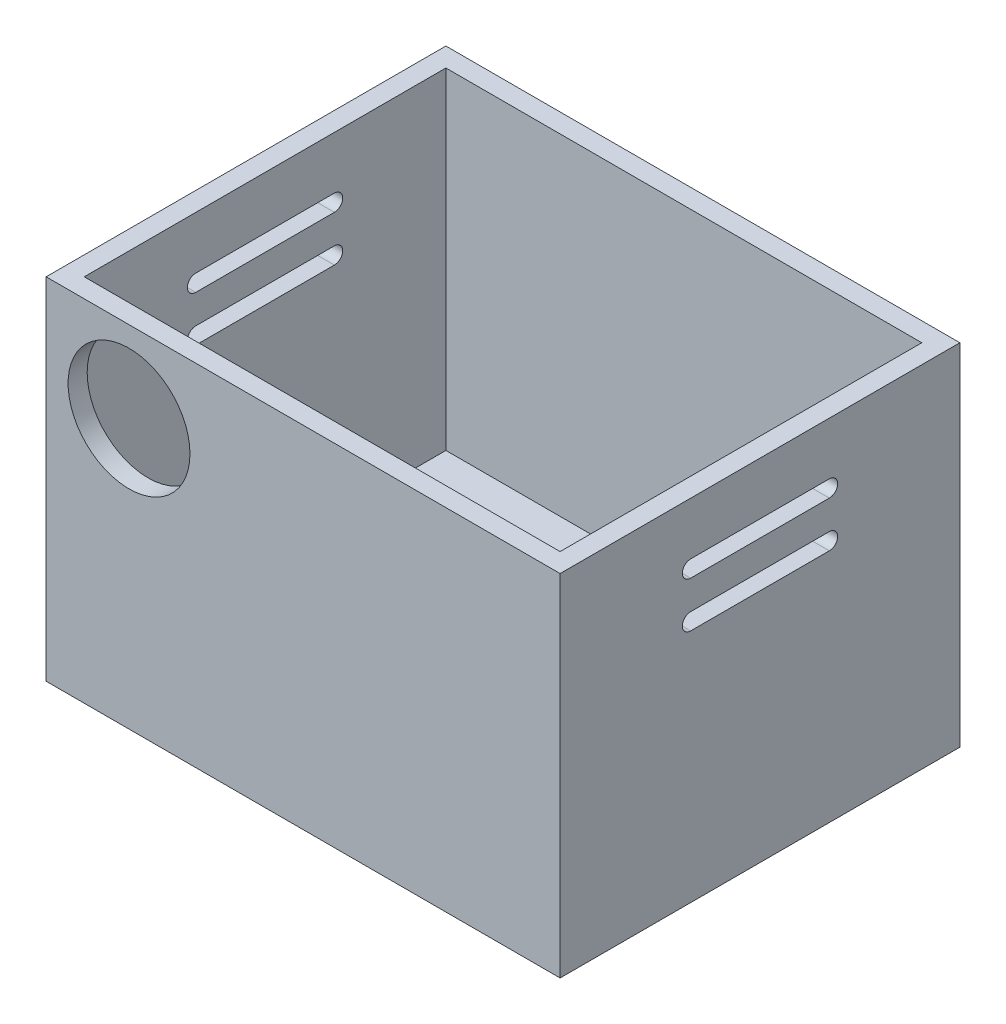
ISO-10303-21;
HEADER;
FILE_DESCRIPTION(('STEP AP214'),'2;1');
FILE_NAME('part.step','',(''),(''),'','','');
FILE_SCHEMA(('AUTOMOTIVE_DESIGN { 1 0 10303 214 1 1 1 1 }'));
ENDSEC;
DATA;
#1=APPLICATION_CONTEXT('core data for automotive mechanical design processes');
#2=APPLICATION_PROTOCOL_DEFINITION('international standard','automotive_design',2000,#1);
#3=PRODUCT_CONTEXT('',#1,'mechanical');
#4=PRODUCT('Part','Part','',(#3));
#5=PRODUCT_RELATED_PRODUCT_CATEGORY('part','',(#4));
#6=PRODUCT_DEFINITION_FORMATION('','',#4);
#7=PRODUCT_DEFINITION_CONTEXT('part definition',#1,'design');
#8=PRODUCT_DEFINITION('design','',#6,#7);
#9=PRODUCT_DEFINITION_SHAPE('','',#8);
#10=(LENGTH_UNIT() NAMED_UNIT(*) SI_UNIT(.MILLI.,.METRE.));
#11=(NAMED_UNIT(*) PLANE_ANGLE_UNIT() SI_UNIT($,.RADIAN.));
#12=(NAMED_UNIT(*) SI_UNIT($,.STERADIAN.) SOLID_ANGLE_UNIT());
#13=UNCERTAINTY_MEASURE_WITH_UNIT(LENGTH_MEASURE(1.E-05),#10,'distance_accuracy_value','');
#14=(GEOMETRIC_REPRESENTATION_CONTEXT(3) GLOBAL_UNCERTAINTY_ASSIGNED_CONTEXT((#13)) GLOBAL_UNIT_ASSIGNED_CONTEXT((#10,
#11,#12)) REPRESENTATION_CONTEXT('',''));
#15=CARTESIAN_POINT('',(0.,0.,0.));
#16=DIRECTION('',(0.,0.,1.));
#17=DIRECTION('',(1.,0.,0.));
#18=AXIS2_PLACEMENT_3D('',#15,#16,#17);
#19=CARTESIAN_POINT('',(42.8625,58.42,-33.3375));
#20=DIRECTION('',(1.,0.,0.));
#21=DIRECTION('',(0.,0.,-1.));
#22=AXIS2_PLACEMENT_3D('',#19,#20,#21);
#23=PLANE('',#22);
#24=CARTESIAN_POINT('',(42.8625,48.26,11.564874));
#25=DIRECTION('',(1.,0.,0.));
#26=DIRECTION('',(0.,0.,-1.));
#27=AXIS2_PLACEMENT_3D('',#24,#25,#26);
#28=CIRCLE('',#27,1.38912599999999);
#29=CARTESIAN_POINT('',(42.8625,49.649126,11.564874));
#30=VERTEX_POINT('',#29);
#31=CARTESIAN_POINT('',(42.8625,46.870874,11.564874));
#32=VERTEX_POINT('',#31);
#33=EDGE_CURVE('E375',#30,#32,#28,.T.);
#34=ORIENTED_EDGE('',*,*,#33,.F.);
#35=DIRECTION('',(0.,0.,1.));
#36=VECTOR('',#35,1.);
#37=CARTESIAN_POINT('',(42.8625,49.649126,-11.564874));
#38=LINE('',#37,#36);
#39=CARTESIAN_POINT('',(42.8625,49.649126,-11.564874));
#40=VERTEX_POINT('',#39);
#41=EDGE_CURVE('E361',#40,#30,#38,.T.);
#42=ORIENTED_EDGE('',*,*,#41,.F.);
#43=CARTESIAN_POINT('',(42.8625,48.26,-11.564874));
#44=DIRECTION('',(1.,0.,0.));
#45=DIRECTION('',(0.,0.,-1.));
#46=AXIS2_PLACEMENT_3D('',#43,#44,#45);
#47=CIRCLE('',#46,1.38912599999999);
#48=CARTESIAN_POINT('',(42.8625,46.870874,-11.564874));
#49=VERTEX_POINT('',#48);
#50=EDGE_CURVE('E366',#49,#40,#47,.T.);
#51=ORIENTED_EDGE('',*,*,#50,.F.);
#52=DIRECTION('',(0.,0.,1.));
#53=VECTOR('',#52,1.);
#54=CARTESIAN_POINT('',(42.8625,46.870874,-11.564874));
#55=LINE('',#54,#53);
#56=EDGE_CURVE('E350',#49,#32,#55,.T.);
#57=ORIENTED_EDGE('',*,*,#56,.T.);
#58=EDGE_LOOP('',(#34,#42,#51,#57));
#59=FACE_BOUND('',#58,.T.);
#60=DIRECTION('',(0.,0.,1.));
#61=VECTOR('',#60,1.);
#62=CARTESIAN_POINT('',(42.8625,0.,-33.3375));
#63=LINE('',#62,#61);
#64=CARTESIAN_POINT('',(42.8625,0.,-33.3375));
#65=VERTEX_POINT('',#64);
#66=CARTESIAN_POINT('',(42.8625,0.,33.3375));
#67=VERTEX_POINT('',#66);
#68=EDGE_CURVE('E493',#65,#67,#63,.T.);
#69=ORIENTED_EDGE('',*,*,#68,.F.);
#70=DIRECTION('',(0.,-1.,0.));
#71=VECTOR('',#70,1.);
#72=CARTESIAN_POINT('',(42.8625,58.42,-33.3375));
#73=LINE('',#72,#71);
#74=CARTESIAN_POINT('',(42.8625,58.42,-33.3375));
#75=VERTEX_POINT('',#74);
#76=EDGE_CURVE('E499',#75,#65,#73,.T.);
#77=ORIENTED_EDGE('',*,*,#76,.F.);
#78=DIRECTION('',(0.,0.,1.));
#79=VECTOR('',#78,1.);
#80=CARTESIAN_POINT('',(42.8625,58.42,-33.3375));
#81=LINE('',#80,#79);
#82=CARTESIAN_POINT('',(42.8625,58.42,33.3375));
#83=VERTEX_POINT('',#82);
#84=EDGE_CURVE('E481',#75,#83,#81,.T.);
#85=ORIENTED_EDGE('',*,*,#84,.T.);
#86=DIRECTION('',(0.,-1.,0.));
#87=VECTOR('',#86,1.);
#88=CARTESIAN_POINT('',(42.8625,58.42,33.3375));
#89=LINE('',#88,#87);
#90=EDGE_CURVE('E501',#83,#67,#89,.T.);
#91=ORIENTED_EDGE('',*,*,#90,.T.);
#92=EDGE_LOOP('',(#69,#77,#85,#91));
#93=FACE_BOUND('',#92,.T.);
#94=CARTESIAN_POINT('',(42.8625,40.64,-11.564874));
#95=DIRECTION('',(1.,0.,0.));
#96=DIRECTION('',(0.,0.,-1.));
#97=AXIS2_PLACEMENT_3D('',#94,#95,#96);
#98=CIRCLE('',#97,1.38912599999999);
#99=CARTESIAN_POINT('',(42.8625,39.250874,-11.564874));
#100=VERTEX_POINT('',#99);
#101=CARTESIAN_POINT('',(42.8625,42.029126,-11.564874));
#102=VERTEX_POINT('',#101);
#103=EDGE_CURVE('E405',#100,#102,#98,.T.);
#104=ORIENTED_EDGE('',*,*,#103,.F.);
#105=DIRECTION('',(0.,0.,1.));
#106=VECTOR('',#105,1.);
#107=CARTESIAN_POINT('',(42.8625,39.250874,-11.564874));
#108=LINE('',#107,#106);
#109=CARTESIAN_POINT('',(42.8625,39.250874,11.564874));
#110=VERTEX_POINT('',#109);
#111=EDGE_CURVE('E398',#100,#110,#108,.T.);
#112=ORIENTED_EDGE('',*,*,#111,.T.);
#113=CARTESIAN_POINT('',(42.8625,40.64,11.564874));
#114=DIRECTION('',(1.,0.,0.));
#115=DIRECTION('',(0.,0.,-1.));
#116=AXIS2_PLACEMENT_3D('',#113,#114,#115);
#117=CIRCLE('',#116,1.38912599999999);
#118=CARTESIAN_POINT('',(42.8625,42.029126,11.564874));
#119=VERTEX_POINT('',#118);
#120=EDGE_CURVE('E419',#119,#110,#117,.T.);
#121=ORIENTED_EDGE('',*,*,#120,.F.);
#122=DIRECTION('',(0.,0.,1.));
#123=VECTOR('',#122,1.);
#124=CARTESIAN_POINT('',(42.8625,42.029126,-11.564874));
#125=LINE('',#124,#123);
#126=EDGE_CURVE('E391',#102,#119,#125,.T.);
#127=ORIENTED_EDGE('',*,*,#126,.F.);
#128=EDGE_LOOP('',(#104,#112,#121,#127));
#129=FACE_BOUND('',#128,.T.);
#130=ADVANCED_FACE('F183',(#59,#93,#129),#23,.T.);
#131=CARTESIAN_POINT('',(-42.8625,58.42,-33.3375));
#132=DIRECTION('',(1.,0.,0.));
#133=DIRECTION('',(0.,0.,-1.));
#134=AXIS2_PLACEMENT_3D('',#131,#132,#133);
#135=PLANE('',#134);
#136=DIRECTION('',(0.,0.,1.));
#137=VECTOR('',#136,1.);
#138=CARTESIAN_POINT('',(-42.8625,49.649126,-11.564874));
#139=LINE('',#138,#137);
#140=CARTESIAN_POINT('',(-42.8625,49.649126,-11.564874));
#141=VERTEX_POINT('',#140);
#142=CARTESIAN_POINT('',(-42.8625,49.649126,11.564874));
#143=VERTEX_POINT('',#142);
#144=EDGE_CURVE('E353',#141,#143,#139,.T.);
#145=ORIENTED_EDGE('',*,*,#144,.T.);
#146=CARTESIAN_POINT('',(-42.8625,48.26,11.564874));
#147=DIRECTION('',(1.,0.,0.));
#148=DIRECTION('',(0.,0.,-1.));
#149=AXIS2_PLACEMENT_3D('',#146,#147,#148);
#150=CIRCLE('',#149,1.38912599999998);
#151=CARTESIAN_POINT('',(-42.8625,46.870874,11.564874));
#152=VERTEX_POINT('',#151);
#153=EDGE_CURVE('E378',#143,#152,#150,.T.);
#154=ORIENTED_EDGE('',*,*,#153,.T.);
#155=DIRECTION('',(0.,0.,1.));
#156=VECTOR('',#155,1.);
#157=CARTESIAN_POINT('',(-42.8625,46.870874,-11.564874));
#158=LINE('',#157,#156);
#159=CARTESIAN_POINT('',(-42.8625,46.870874,-11.564874));
#160=VERTEX_POINT('',#159);
#161=EDGE_CURVE('E360',#160,#152,#158,.T.);
#162=ORIENTED_EDGE('',*,*,#161,.F.);
#163=CARTESIAN_POINT('',(-42.8625,48.26,-11.564874));
#164=DIRECTION('',(1.,0.,0.));
#165=DIRECTION('',(0.,0.,-1.));
#166=AXIS2_PLACEMENT_3D('',#163,#164,#165);
#167=CIRCLE('',#166,1.38912599999998);
#168=EDGE_CURVE('E206',#160,#141,#167,.T.);
#169=ORIENTED_EDGE('',*,*,#168,.T.);
#170=EDGE_LOOP('',(#145,#154,#162,#169));
#171=FACE_BOUND('',#170,.T.);
#172=DIRECTION('',(0.,0.,1.));
#173=VECTOR('',#172,1.);
#174=CARTESIAN_POINT('',(-42.8625,39.250874,-11.564874));
#175=LINE('',#174,#173);
#176=CARTESIAN_POINT('',(-42.8625,39.250874,-11.564874));
#177=VERTEX_POINT('',#176);
#178=CARTESIAN_POINT('',(-42.8625,39.250874,11.564874));
#179=VERTEX_POINT('',#178);
#180=EDGE_CURVE('E396',#177,#179,#175,.T.);
#181=ORIENTED_EDGE('',*,*,#180,.F.);
#182=CARTESIAN_POINT('',(-42.8625,40.64,-11.564874));
#183=DIRECTION('',(1.,0.,0.));
#184=DIRECTION('',(0.,0.,-1.));
#185=AXIS2_PLACEMENT_3D('',#182,#183,#184);
#186=CIRCLE('',#185,1.38912599999998);
#187=CARTESIAN_POINT('',(-42.8625,42.029126,-11.564874));
#188=VERTEX_POINT('',#187);
#189=EDGE_CURVE('E408',#177,#188,#186,.T.);
#190=ORIENTED_EDGE('',*,*,#189,.T.);
#191=DIRECTION('',(0.,0.,1.));
#192=VECTOR('',#191,1.);
#193=CARTESIAN_POINT('',(-42.8625,42.029126,-11.564874));
#194=LINE('',#193,#192);
#195=CARTESIAN_POINT('',(-42.8625,42.029126,11.564874));
#196=VERTEX_POINT('',#195);
#197=EDGE_CURVE('E393',#188,#196,#194,.T.);
#198=ORIENTED_EDGE('',*,*,#197,.T.);
#199=CARTESIAN_POINT('',(-42.8625,40.64,11.564874));
#200=DIRECTION('',(1.,0.,0.));
#201=DIRECTION('',(0.,0.,-1.));
#202=AXIS2_PLACEMENT_3D('',#199,#200,#201);
#203=CIRCLE('',#202,1.38912599999998);
#204=EDGE_CURVE('E422',#196,#179,#203,.T.);
#205=ORIENTED_EDGE('',*,*,#204,.T.);
#206=EDGE_LOOP('',(#181,#190,#198,#205));
#207=FACE_BOUND('',#206,.T.);
#208=DIRECTION('',(0.,0.,1.));
#209=VECTOR('',#208,1.);
#210=CARTESIAN_POINT('',(-42.8625,0.,-33.3375));
#211=LINE('',#210,#209);
#212=CARTESIAN_POINT('',(-42.8625,0.,-33.3375));
#213=VERTEX_POINT('',#212);
#214=CARTESIAN_POINT('',(-42.8625,0.,33.3375));
#215=VERTEX_POINT('',#214);
#216=EDGE_CURVE('E450',#213,#215,#211,.T.);
#217=ORIENTED_EDGE('',*,*,#216,.T.);
#218=DIRECTION('',(0.,-1.,0.));
#219=VECTOR('',#218,1.);
#220=CARTESIAN_POINT('',(-42.8625,58.42,33.3375));
#221=LINE('',#220,#219);
#222=CARTESIAN_POINT('',(-42.8625,58.42,33.3375));
#223=VERTEX_POINT('',#222);
#224=EDGE_CURVE('E503',#223,#215,#221,.T.);
#225=ORIENTED_EDGE('',*,*,#224,.F.);
#226=DIRECTION('',(0.,0.,1.));
#227=VECTOR('',#226,1.);
#228=CARTESIAN_POINT('',(-42.8625,58.42,-33.3375));
#229=LINE('',#228,#227);
#230=CARTESIAN_POINT('',(-42.8625,58.42,-33.3375));
#231=VERTEX_POINT('',#230);
#232=EDGE_CURVE('E475',#231,#223,#229,.T.);
#233=ORIENTED_EDGE('',*,*,#232,.F.);
#234=DIRECTION('',(0.,-1.,0.));
#235=VECTOR('',#234,1.);
#236=CARTESIAN_POINT('',(-42.8625,58.42,-33.3375));
#237=LINE('',#236,#235);
#238=EDGE_CURVE('E487',#231,#213,#237,.T.);
#239=ORIENTED_EDGE('',*,*,#238,.T.);
#240=EDGE_LOOP('',(#217,#225,#233,#239));
#241=FACE_BOUND('',#240,.T.);
#242=ADVANCED_FACE('F185',(#171,#207,#241),#135,.F.);
#243=CARTESIAN_POINT('',(-42.8625,58.42,33.3375));
#244=DIRECTION('',(0.,0.,-1.));
#245=DIRECTION('',(-1.,0.,0.));
#246=AXIS2_PLACEMENT_3D('',#243,#244,#245);
#247=PLANE('',#246);
#248=CARTESIAN_POINT('',(-29.0334989565251,44.8588108969985,33.3375));
#249=DIRECTION('',(0.,0.,1.));
#250=DIRECTION('',(1.,0.,0.));
#251=AXIS2_PLACEMENT_3D('',#248,#249,#250);
#252=CIRCLE('',#251,10.16);
#253=CARTESIAN_POINT('',(-18.8734989565251,44.8588108969985,33.3375));
#254=VERTEX_POINT('',#253);
#255=EDGE_CURVE('E437',#254,#254,#252,.T.);
#256=ORIENTED_EDGE('',*,*,#255,.F.);
#257=EDGE_LOOP('',(#256));
#258=FACE_BOUND('',#257,.T.);
#259=DIRECTION('',(1.,0.,0.));
#260=VECTOR('',#259,1.);
#261=CARTESIAN_POINT('',(-42.8625,0.,33.3375));
#262=LINE('',#261,#260);
#263=EDGE_CURVE('E490',#215,#67,#262,.T.);
#264=ORIENTED_EDGE('',*,*,#263,.T.);
#265=ORIENTED_EDGE('',*,*,#90,.F.);
#266=DIRECTION('',(1.,0.,0.));
#267=VECTOR('',#266,1.);
#268=CARTESIAN_POINT('',(-42.8625,58.42,33.3375));
#269=LINE('',#268,#267);
#270=EDGE_CURVE('E478',#223,#83,#269,.T.);
#271=ORIENTED_EDGE('',*,*,#270,.F.);
#272=ORIENTED_EDGE('',*,*,#224,.T.);
#273=EDGE_LOOP('',(#264,#265,#271,#272));
#274=FACE_BOUND('',#273,.T.);
#275=ADVANCED_FACE('F568',(#258,#274),#247,.F.);
#276=CARTESIAN_POINT('',(-42.8625,58.42,-33.3375));
#277=DIRECTION('',(0.,0.,-1.));
#278=DIRECTION('',(-1.,0.,0.));
#279=AXIS2_PLACEMENT_3D('',#276,#277,#278);
#280=PLANE('',#279);
#281=DIRECTION('',(1.,0.,0.));
#282=VECTOR('',#281,1.);
#283=CARTESIAN_POINT('',(-42.8625,0.,-33.3375));
#284=LINE('',#283,#282);
#285=EDGE_CURVE('E479',#213,#65,#284,.T.);
#286=ORIENTED_EDGE('',*,*,#285,.F.);
#287=ORIENTED_EDGE('',*,*,#238,.F.);
#288=DIRECTION('',(1.,0.,0.));
#289=VECTOR('',#288,1.);
#290=CARTESIAN_POINT('',(-42.8625,58.42,-33.3375));
#291=LINE('',#290,#289);
#292=EDGE_CURVE('E484',#231,#75,#291,.T.);
#293=ORIENTED_EDGE('',*,*,#292,.T.);
#294=ORIENTED_EDGE('',*,*,#76,.T.);
#295=EDGE_LOOP('',(#286,#287,#293,#294));
#296=FACE_BOUND('',#295,.T.);
#297=ADVANCED_FACE('F570',(#296),#280,.T.);
#298=CARTESIAN_POINT('',(0.,58.42,0.));
#299=DIRECTION('',(0.,1.,0.));
#300=DIRECTION('',(0.,0.,1.));
#301=AXIS2_PLACEMENT_3D('',#298,#299,#300);
#302=PLANE('',#301);
#303=DIRECTION('',(0.,0.,1.));
#304=VECTOR('',#303,1.);
#305=CARTESIAN_POINT('',(-39.6875,58.42,-33.3375));
#306=LINE('',#305,#304);
#307=CARTESIAN_POINT('',(-39.6875,58.42,-30.1625));
#308=VERTEX_POINT('',#307);
#309=CARTESIAN_POINT('',(-39.6875,58.42,30.1625));
#310=VERTEX_POINT('',#309);
#311=EDGE_CURVE('E466',#308,#310,#306,.T.);
#312=ORIENTED_EDGE('',*,*,#311,.F.);
#313=DIRECTION('',(1.,0.,0.));
#314=VECTOR('',#313,1.);
#315=CARTESIAN_POINT('',(-42.8625,58.42,-30.1625));
#316=LINE('',#315,#314);
#317=CARTESIAN_POINT('',(39.6875,58.42,-30.1625));
#318=VERTEX_POINT('',#317);
#319=EDGE_CURVE('E455',#308,#318,#316,.T.);
#320=ORIENTED_EDGE('',*,*,#319,.T.);
#321=DIRECTION('',(0.,0.,1.));
#322=VECTOR('',#321,1.);
#323=CARTESIAN_POINT('',(39.6875,58.42,-33.3375));
#324=LINE('',#323,#322);
#325=CARTESIAN_POINT('',(39.6875,58.42,30.1625));
#326=VERTEX_POINT('',#325);
#327=EDGE_CURVE('E470',#318,#326,#324,.T.);
#328=ORIENTED_EDGE('',*,*,#327,.T.);
#329=DIRECTION('',(1.,0.,0.));
#330=VECTOR('',#329,1.);
#331=CARTESIAN_POINT('',(-42.8625,58.42,30.1625));
#332=LINE('',#331,#330);
#333=EDGE_CURVE('E468',#310,#326,#332,.T.);
#334=ORIENTED_EDGE('',*,*,#333,.F.);
#335=EDGE_LOOP('',(#312,#320,#328,#334));
#336=FACE_BOUND('',#335,.T.);
#337=ORIENTED_EDGE('',*,*,#232,.T.);
#338=ORIENTED_EDGE('',*,*,#270,.T.);
#339=ORIENTED_EDGE('',*,*,#84,.F.);
#340=ORIENTED_EDGE('',*,*,#292,.F.);
#341=EDGE_LOOP('',(#337,#338,#339,#340));
#342=FACE_BOUND('',#341,.T.);
#343=ADVANCED_FACE('F577',(#336,#342),#302,.T.);
#344=CARTESIAN_POINT('',(0.,0.,0.));
#345=DIRECTION('',(0.,1.,0.));
#346=DIRECTION('',(0.,0.,1.));
#347=AXIS2_PLACEMENT_3D('',#344,#345,#346);
#348=PLANE('',#347);
#349=ORIENTED_EDGE('',*,*,#216,.F.);
#350=ORIENTED_EDGE('',*,*,#285,.T.);
#351=ORIENTED_EDGE('',*,*,#68,.T.);
#352=ORIENTED_EDGE('',*,*,#263,.F.);
#353=EDGE_LOOP('',(#349,#350,#351,#352));
#354=FACE_BOUND('',#353,.T.);
#355=ADVANCED_FACE('F586',(#354),#348,.F.);
#356=CARTESIAN_POINT('',(-39.6875,58.42,-33.3375));
#357=DIRECTION('',(1.,0.,0.));
#358=DIRECTION('',(0.,0.,-1.));
#359=AXIS2_PLACEMENT_3D('',#356,#357,#358);
#360=PLANE('',#359);
#361=DIRECTION('',(0.,0.,-1.));
#362=VECTOR('',#361,1.);
#363=CARTESIAN_POINT('',(-39.6875,46.870874,-33.3375));
#364=LINE('',#363,#362);
#365=CARTESIAN_POINT('',(-39.6875,46.870874,11.564874));
#366=VERTEX_POINT('',#365);
#367=CARTESIAN_POINT('',(-39.6875,46.870874,-11.564874));
#368=VERTEX_POINT('',#367);
#369=EDGE_CURVE('E388',#366,#368,#364,.T.);
#370=ORIENTED_EDGE('',*,*,#369,.F.);
#371=CARTESIAN_POINT('',(-39.6875,48.26,11.564874));
#372=DIRECTION('',(1.,0.,0.));
#373=DIRECTION('',(0.,0.,-1.));
#374=AXIS2_PLACEMENT_3D('',#371,#372,#373);
#375=CIRCLE('',#374,1.38912599999998);
#376=CARTESIAN_POINT('',(-39.6875,49.649126,11.564874));
#377=VERTEX_POINT('',#376);
#378=EDGE_CURVE('E386',#377,#366,#375,.T.);
#379=ORIENTED_EDGE('',*,*,#378,.F.);
#380=DIRECTION('',(0.,0.,1.));
#381=VECTOR('',#380,1.);
#382=CARTESIAN_POINT('',(-39.6875,49.649126,-33.3375));
#383=LINE('',#382,#381);
#384=CARTESIAN_POINT('',(-39.6875,49.649126,-11.564874));
#385=VERTEX_POINT('',#384);
#386=EDGE_CURVE('E384',#385,#377,#383,.T.);
#387=ORIENTED_EDGE('',*,*,#386,.F.);
#388=CARTESIAN_POINT('',(-39.6875,48.26,-11.564874));
#389=DIRECTION('',(1.,0.,0.));
#390=DIRECTION('',(0.,0.,-1.));
#391=AXIS2_PLACEMENT_3D('',#388,#389,#390);
#392=CIRCLE('',#391,1.38912599999998);
#393=EDGE_CURVE('E347',#368,#385,#392,.T.);
#394=ORIENTED_EDGE('',*,*,#393,.F.);
#395=EDGE_LOOP('',(#370,#379,#387,#394));
#396=FACE_BOUND('',#395,.T.);
#397=DIRECTION('',(0.,0.,1.));
#398=VECTOR('',#397,1.);
#399=CARTESIAN_POINT('',(-39.6875,42.029126,-33.3375));
#400=LINE('',#399,#398);
#401=CARTESIAN_POINT('',(-39.6875,42.029126,-11.564874));
#402=VERTEX_POINT('',#401);
#403=CARTESIAN_POINT('',(-39.6875,42.029126,11.564874));
#404=VERTEX_POINT('',#403);
#405=EDGE_CURVE('E435',#402,#404,#400,.T.);
#406=ORIENTED_EDGE('',*,*,#405,.F.);
#407=CARTESIAN_POINT('',(-39.6875,40.64,-11.564874));
#408=DIRECTION('',(1.,0.,0.));
#409=DIRECTION('',(0.,0.,-1.));
#410=AXIS2_PLACEMENT_3D('',#407,#408,#409);
#411=CIRCLE('',#410,1.38912599999998);
#412=CARTESIAN_POINT('',(-39.6875,39.250874,-11.564874));
#413=VERTEX_POINT('',#412);
#414=EDGE_CURVE('E433',#413,#402,#411,.T.);
#415=ORIENTED_EDGE('',*,*,#414,.F.);
#416=DIRECTION('',(0.,0.,-1.));
#417=VECTOR('',#416,1.);
#418=CARTESIAN_POINT('',(-39.6875,39.250874,-33.3375));
#419=LINE('',#418,#417);
#420=CARTESIAN_POINT('',(-39.6875,39.250874,11.564874));
#421=VERTEX_POINT('',#420);
#422=EDGE_CURVE('E431',#421,#413,#419,.T.);
#423=ORIENTED_EDGE('',*,*,#422,.F.);
#424=CARTESIAN_POINT('',(-39.6875,40.64,11.564874));
#425=DIRECTION('',(1.,0.,0.));
#426=DIRECTION('',(0.,0.,-1.));
#427=AXIS2_PLACEMENT_3D('',#424,#425,#426);
#428=CIRCLE('',#427,1.38912599999998);
#429=EDGE_CURVE('E428',#404,#421,#428,.T.);
#430=ORIENTED_EDGE('',*,*,#429,.F.);
#431=EDGE_LOOP('',(#406,#415,#423,#430));
#432=FACE_BOUND('',#431,.T.);
#433=DIRECTION('',(0.,0.,1.));
#434=VECTOR('',#433,1.);
#435=CARTESIAN_POINT('',(-39.6875,3.175,-33.3375));
#436=LINE('',#435,#434);
#437=CARTESIAN_POINT('',(-39.6875,3.175,-30.1625));
#438=VERTEX_POINT('',#437);
#439=CARTESIAN_POINT('',(-39.6875,3.175,30.1625));
#440=VERTEX_POINT('',#439);
#441=EDGE_CURVE('E443',#438,#440,#436,.T.);
#442=ORIENTED_EDGE('',*,*,#441,.F.);
#443=DIRECTION('',(0.,-1.,0.));
#444=VECTOR('',#443,1.);
#445=CARTESIAN_POINT('',(-39.6875,58.42,-30.1625));
#446=LINE('',#445,#444);
#447=EDGE_CURVE('E452',#308,#438,#446,.T.);
#448=ORIENTED_EDGE('',*,*,#447,.F.);
#449=ORIENTED_EDGE('',*,*,#311,.T.);
#450=DIRECTION('',(0.,-1.,0.));
#451=VECTOR('',#450,1.);
#452=CARTESIAN_POINT('',(-39.6875,58.42,30.1625));
#453=LINE('',#452,#451);
#454=EDGE_CURVE('E447',#310,#440,#453,.T.);
#455=ORIENTED_EDGE('',*,*,#454,.T.);
#456=EDGE_LOOP('',(#442,#448,#449,#455));
#457=FACE_BOUND('',#456,.T.);
#458=ADVANCED_FACE('F600',(#396,#432,#457),#360,.T.);
#459=CARTESIAN_POINT('',(-42.8625,58.42,30.1625));
#460=DIRECTION('',(0.,0.,-1.));
#461=DIRECTION('',(-1.,0.,0.));
#462=AXIS2_PLACEMENT_3D('',#459,#460,#461);
#463=PLANE('',#462);
#464=CARTESIAN_POINT('',(-29.0334989565251,44.8588108969985,30.1625));
#465=DIRECTION('',(0.,0.,-1.));
#466=DIRECTION('',(-1.,0.,0.));
#467=AXIS2_PLACEMENT_3D('',#464,#465,#466);
#468=CIRCLE('',#467,10.16);
#469=CARTESIAN_POINT('',(-39.1934989565251,44.8588108969985,30.1625));
#470=VERTEX_POINT('',#469);
#471=EDGE_CURVE('E440',#470,#470,#468,.T.);
#472=ORIENTED_EDGE('',*,*,#471,.F.);
#473=EDGE_LOOP('',(#472));
#474=FACE_BOUND('',#473,.T.);
#475=DIRECTION('',(1.,0.,0.));
#476=VECTOR('',#475,1.);
#477=CARTESIAN_POINT('',(-42.8625,3.175,30.1625));
#478=LINE('',#477,#476);
#479=CARTESIAN_POINT('',(39.6875,3.175,30.1625));
#480=VERTEX_POINT('',#479);
#481=EDGE_CURVE('E446',#440,#480,#478,.T.);
#482=ORIENTED_EDGE('',*,*,#481,.F.);
#483=ORIENTED_EDGE('',*,*,#454,.F.);
#484=ORIENTED_EDGE('',*,*,#333,.T.);
#485=DIRECTION('',(0.,-1.,0.));
#486=VECTOR('',#485,1.);
#487=CARTESIAN_POINT('',(39.6875,58.42,30.1625));
#488=LINE('',#487,#486);
#489=EDGE_CURVE('E451',#326,#480,#488,.T.);
#490=ORIENTED_EDGE('',*,*,#489,.T.);
#491=EDGE_LOOP('',(#482,#483,#484,#490));
#492=FACE_BOUND('',#491,.T.);
#493=ADVANCED_FACE('F614',(#474,#492),#463,.T.);
#494=CARTESIAN_POINT('',(39.6875,58.42,-33.3375));
#495=DIRECTION('',(1.,0.,0.));
#496=DIRECTION('',(0.,0.,-1.));
#497=AXIS2_PLACEMENT_3D('',#494,#495,#496);
#498=PLANE('',#497);
#499=DIRECTION('',(0.,0.,-1.));
#500=VECTOR('',#499,1.);
#501=CARTESIAN_POINT('',(39.6875,46.870874,-33.3375));
#502=LINE('',#501,#500);
#503=CARTESIAN_POINT('',(39.6875,46.870874,11.564874));
#504=VERTEX_POINT('',#503);
#505=CARTESIAN_POINT('',(39.6875,46.870874,-11.564874));
#506=VERTEX_POINT('',#505);
#507=EDGE_CURVE('E191',#504,#506,#502,.T.);
#508=ORIENTED_EDGE('',*,*,#507,.T.);
#509=CARTESIAN_POINT('',(39.6875,48.26,-11.564874));
#510=DIRECTION('',(1.,0.,0.));
#511=DIRECTION('',(0.,0.,-1.));
#512=AXIS2_PLACEMENT_3D('',#509,#510,#511);
#513=CIRCLE('',#512,1.38912599999998);
#514=CARTESIAN_POINT('',(39.6875,49.649126,-11.564874));
#515=VERTEX_POINT('',#514);
#516=EDGE_CURVE('E13',#506,#515,#513,.T.);
#517=ORIENTED_EDGE('',*,*,#516,.T.);
#518=DIRECTION('',(0.,0.,1.));
#519=VECTOR('',#518,1.);
#520=CARTESIAN_POINT('',(39.6875,49.649126,-33.3375));
#521=LINE('',#520,#519);
#522=CARTESIAN_POINT('',(39.6875,49.649126,11.564874));
#523=VERTEX_POINT('',#522);
#524=EDGE_CURVE('E518',#515,#523,#521,.T.);
#525=ORIENTED_EDGE('',*,*,#524,.T.);
#526=CARTESIAN_POINT('',(39.6875,48.26,11.564874));
#527=DIRECTION('',(1.,0.,0.));
#528=DIRECTION('',(0.,0.,-1.));
#529=AXIS2_PLACEMENT_3D('',#526,#527,#528);
#530=CIRCLE('',#529,1.38912599999998);
#531=EDGE_CURVE('E521',#523,#504,#530,.T.);
#532=ORIENTED_EDGE('',*,*,#531,.T.);
#533=EDGE_LOOP('',(#508,#517,#525,#532));
#534=FACE_BOUND('',#533,.T.);
#535=CARTESIAN_POINT('',(39.6875,40.64,-11.564874));
#536=DIRECTION('',(1.,0.,0.));
#537=DIRECTION('',(0.,0.,-1.));
#538=AXIS2_PLACEMENT_3D('',#535,#536,#537);
#539=CIRCLE('',#538,1.38912599999998);
#540=CARTESIAN_POINT('',(39.6875,39.250874,-11.564874));
#541=VERTEX_POINT('',#540);
#542=CARTESIAN_POINT('',(39.6875,42.029126,-11.564874));
#543=VERTEX_POINT('',#542);
#544=EDGE_CURVE('E512',#541,#543,#539,.T.);
#545=ORIENTED_EDGE('',*,*,#544,.T.);
#546=DIRECTION('',(0.,0.,1.));
#547=VECTOR('',#546,1.);
#548=CARTESIAN_POINT('',(39.6875,42.029126,-33.3375));
#549=LINE('',#548,#547);
#550=CARTESIAN_POINT('',(39.6875,42.029126,11.564874));
#551=VERTEX_POINT('',#550);
#552=EDGE_CURVE('E515',#543,#551,#549,.T.);
#553=ORIENTED_EDGE('',*,*,#552,.T.);
#554=CARTESIAN_POINT('',(39.6875,40.64,11.564874));
#555=DIRECTION('',(1.,0.,0.));
#556=DIRECTION('',(0.,0.,-1.));
#557=AXIS2_PLACEMENT_3D('',#554,#555,#556);
#558=CIRCLE('',#557,1.38912599999998);
#559=CARTESIAN_POINT('',(39.6875,39.250874,11.564874));
#560=VERTEX_POINT('',#559);
#561=EDGE_CURVE('E506',#551,#560,#558,.T.);
#562=ORIENTED_EDGE('',*,*,#561,.T.);
#563=DIRECTION('',(0.,0.,-1.));
#564=VECTOR('',#563,1.);
#565=CARTESIAN_POINT('',(39.6875,39.250874,-33.3375));
#566=LINE('',#565,#564);
#567=EDGE_CURVE('E509',#560,#541,#566,.T.);
#568=ORIENTED_EDGE('',*,*,#567,.T.);
#569=EDGE_LOOP('',(#545,#553,#562,#568));
#570=FACE_BOUND('',#569,.T.);
#571=DIRECTION('',(0.,0.,1.));
#572=VECTOR('',#571,1.);
#573=CARTESIAN_POINT('',(39.6875,3.175,-33.3375));
#574=LINE('',#573,#572);
#575=CARTESIAN_POINT('',(39.6875,3.175,-30.1625));
#576=VERTEX_POINT('',#575);
#577=EDGE_CURVE('E458',#576,#480,#574,.T.);
#578=ORIENTED_EDGE('',*,*,#577,.T.);
#579=ORIENTED_EDGE('',*,*,#489,.F.);
#580=ORIENTED_EDGE('',*,*,#327,.F.);
#581=DIRECTION('',(0.,-1.,0.));
#582=VECTOR('',#581,1.);
#583=CARTESIAN_POINT('',(39.6875,58.42,-30.1625));
#584=LINE('',#583,#582);
#585=EDGE_CURVE('E454',#318,#576,#584,.T.);
#586=ORIENTED_EDGE('',*,*,#585,.T.);
#587=EDGE_LOOP('',(#578,#579,#580,#586));
#588=FACE_BOUND('',#587,.T.);
#589=ADVANCED_FACE('F525',(#534,#570,#588),#498,.F.);
#590=CARTESIAN_POINT('',(-42.8625,58.42,-30.1625));
#591=DIRECTION('',(0.,0.,-1.));
#592=DIRECTION('',(-1.,0.,0.));
#593=AXIS2_PLACEMENT_3D('',#590,#591,#592);
#594=PLANE('',#593);
#595=DIRECTION('',(1.,0.,0.));
#596=VECTOR('',#595,1.);
#597=CARTESIAN_POINT('',(-42.8625,3.175,-30.1625));
#598=LINE('',#597,#596);
#599=EDGE_CURVE('E462',#438,#576,#598,.T.);
#600=ORIENTED_EDGE('',*,*,#599,.T.);
#601=ORIENTED_EDGE('',*,*,#585,.F.);
#602=ORIENTED_EDGE('',*,*,#319,.F.);
#603=ORIENTED_EDGE('',*,*,#447,.T.);
#604=EDGE_LOOP('',(#600,#601,#602,#603));
#605=FACE_BOUND('',#604,.T.);
#606=ADVANCED_FACE('F607',(#605),#594,.F.);
#607=CARTESIAN_POINT('',(0.,3.175,0.));
#608=DIRECTION('',(0.,1.,0.));
#609=DIRECTION('',(0.,0.,1.));
#610=AXIS2_PLACEMENT_3D('',#607,#608,#609);
#611=PLANE('',#610);
#612=ORIENTED_EDGE('',*,*,#441,.T.);
#613=ORIENTED_EDGE('',*,*,#481,.T.);
#614=ORIENTED_EDGE('',*,*,#577,.F.);
#615=ORIENTED_EDGE('',*,*,#599,.F.);
#616=EDGE_LOOP('',(#612,#613,#614,#615));
#617=FACE_BOUND('',#616,.T.);
#618=ADVANCED_FACE('F603',(#617),#611,.T.);
#619=CARTESIAN_POINT('',(-29.0334989565251,44.8588108969985,33.3375));
#620=DIRECTION('',(0.,0.,1.));
#621=DIRECTION('',(1.,0.,0.));
#622=AXIS2_PLACEMENT_3D('',#619,#620,#621);
#623=CYLINDRICAL_SURFACE('',#622,10.16);
#624=ORIENTED_EDGE('',*,*,#255,.T.);
#625=EDGE_LOOP('',(#624));
#626=FACE_BOUND('',#625,.T.);
#627=ORIENTED_EDGE('',*,*,#471,.T.);
#628=EDGE_LOOP('',(#627));
#629=FACE_BOUND('',#628,.T.);
#630=ADVANCED_FACE('F606',(#626,#629),#623,.F.);
#631=CARTESIAN_POINT('',(42.8625,40.64,11.564874));
#632=DIRECTION('',(1.,0.,0.));
#633=DIRECTION('',(0.,0.,-1.));
#634=AXIS2_PLACEMENT_3D('',#631,#632,#633);
#635=CYLINDRICAL_SURFACE('',#634,1.38912599999998);
#636=DIRECTION('',(-1.,0.,0.));
#637=VECTOR('',#636,1.);
#638=CARTESIAN_POINT('',(-42.8625,42.029126,11.564874));
#639=LINE('',#638,#637);
#640=EDGE_CURVE('E416',#119,#551,#639,.T.);
#641=ORIENTED_EDGE('',*,*,#640,.F.);
#642=ORIENTED_EDGE('',*,*,#120,.T.);
#643=DIRECTION('',(1.,0.,0.));
#644=VECTOR('',#643,1.);
#645=CARTESIAN_POINT('',(42.8625,39.250874,11.564874));
#646=LINE('',#645,#644);
#647=EDGE_CURVE('E425',#560,#110,#646,.T.);
#648=ORIENTED_EDGE('',*,*,#647,.F.);
#649=ORIENTED_EDGE('',*,*,#561,.F.);
#650=EDGE_LOOP('',(#641,#642,#648,#649));
#651=FACE_BOUND('',#650,.T.);
#652=ADVANCED_FACE('F623',(#651),#635,.F.);
#653=CARTESIAN_POINT('',(42.8625,39.250874,-11.564874));
#654=DIRECTION('',(0.,-1.,0.));
#655=DIRECTION('',(0.,0.,-1.));
#656=AXIS2_PLACEMENT_3D('',#653,#654,#655);
#657=PLANE('',#656);
#658=ORIENTED_EDGE('',*,*,#647,.T.);
#659=ORIENTED_EDGE('',*,*,#111,.F.);
#660=DIRECTION('',(1.,0.,0.));
#661=VECTOR('',#660,1.);
#662=CARTESIAN_POINT('',(42.8625,39.250874,-11.564874));
#663=LINE('',#662,#661);
#664=EDGE_CURVE('E412',#100,#541,#663,.F.);
#665=ORIENTED_EDGE('',*,*,#664,.T.);
#666=ORIENTED_EDGE('',*,*,#567,.F.);
#667=EDGE_LOOP('',(#658,#659,#665,#666));
#668=FACE_BOUND('',#667,.T.);
#669=ADVANCED_FACE('F636',(#668),#657,.F.);
#670=CARTESIAN_POINT('',(42.8625,40.64,-11.564874));
#671=DIRECTION('',(1.,0.,0.));
#672=DIRECTION('',(0.,0.,-1.));
#673=AXIS2_PLACEMENT_3D('',#670,#671,#672);
#674=CYLINDRICAL_SURFACE('',#673,1.38912599999998);
#675=ORIENTED_EDGE('',*,*,#664,.F.);
#676=ORIENTED_EDGE('',*,*,#103,.T.);
#677=DIRECTION('',(-1.,0.,0.));
#678=VECTOR('',#677,1.);
#679=CARTESIAN_POINT('',(-42.8625,42.029126,-11.564874));
#680=LINE('',#679,#678);
#681=EDGE_CURVE('E402',#102,#543,#680,.T.);
#682=ORIENTED_EDGE('',*,*,#681,.T.);
#683=ORIENTED_EDGE('',*,*,#544,.F.);
#684=EDGE_LOOP('',(#675,#676,#682,#683));
#685=FACE_BOUND('',#684,.T.);
#686=ADVANCED_FACE('F633',(#685),#674,.F.);
#687=CARTESIAN_POINT('',(-42.8625,42.029126,-11.564874));
#688=DIRECTION('',(0.,1.,0.));
#689=DIRECTION('',(-1.,0.,0.));
#690=AXIS2_PLACEMENT_3D('',#687,#688,#689);
#691=PLANE('',#690);
#692=ORIENTED_EDGE('',*,*,#681,.F.);
#693=ORIENTED_EDGE('',*,*,#126,.T.);
#694=ORIENTED_EDGE('',*,*,#640,.T.);
#695=ORIENTED_EDGE('',*,*,#552,.F.);
#696=EDGE_LOOP('',(#692,#693,#694,#695));
#697=FACE_BOUND('',#696,.T.);
#698=ADVANCED_FACE('F559',(#697),#691,.F.);
#699=ORIENTED_EDGE('',*,*,#429,.T.);
#700=EDGE_CURVE('E426',#179,#421,#646,.T.);
#701=ORIENTED_EDGE('',*,*,#700,.F.);
#702=ORIENTED_EDGE('',*,*,#204,.F.);
#703=EDGE_CURVE('E415',#404,#196,#639,.T.);
#704=ORIENTED_EDGE('',*,*,#703,.F.);
#705=EDGE_LOOP('',(#699,#701,#702,#704));
#706=FACE_BOUND('',#705,.T.);
#707=ADVANCED_FACE('F625',(#706),#635,.F.);
#708=ORIENTED_EDGE('',*,*,#414,.T.);
#709=EDGE_CURVE('E401',#402,#188,#680,.T.);
#710=ORIENTED_EDGE('',*,*,#709,.T.);
#711=ORIENTED_EDGE('',*,*,#189,.F.);
#712=EDGE_CURVE('E411',#413,#177,#663,.F.);
#713=ORIENTED_EDGE('',*,*,#712,.F.);
#714=EDGE_LOOP('',(#708,#710,#711,#713));
#715=FACE_BOUND('',#714,.T.);
#716=ADVANCED_FACE('F628',(#715),#674,.F.);
#717=ORIENTED_EDGE('',*,*,#422,.T.);
#718=ORIENTED_EDGE('',*,*,#712,.T.);
#719=ORIENTED_EDGE('',*,*,#180,.T.);
#720=ORIENTED_EDGE('',*,*,#700,.T.);
#721=EDGE_LOOP('',(#717,#718,#719,#720));
#722=FACE_BOUND('',#721,.T.);
#723=ADVANCED_FACE('F556',(#722),#657,.F.);
#724=ORIENTED_EDGE('',*,*,#405,.T.);
#725=ORIENTED_EDGE('',*,*,#703,.T.);
#726=ORIENTED_EDGE('',*,*,#197,.F.);
#727=ORIENTED_EDGE('',*,*,#709,.F.);
#728=EDGE_LOOP('',(#724,#725,#726,#727));
#729=FACE_BOUND('',#728,.T.);
#730=ADVANCED_FACE('F548',(#729),#691,.F.);
#731=CARTESIAN_POINT('',(-42.8625,49.649126,-11.564874));
#732=DIRECTION('',(0.,1.,0.));
#733=DIRECTION('',(-1.,0.,0.));
#734=AXIS2_PLACEMENT_3D('',#731,#732,#733);
#735=PLANE('',#734);
#736=DIRECTION('',(-1.,0.,0.));
#737=VECTOR('',#736,1.);
#738=CARTESIAN_POINT('',(-42.8625,49.649126,-11.564874));
#739=LINE('',#738,#737);
#740=EDGE_CURVE('E198',#40,#515,#739,.T.);
#741=ORIENTED_EDGE('',*,*,#740,.F.);
#742=ORIENTED_EDGE('',*,*,#41,.T.);
#743=DIRECTION('',(-1.,0.,0.));
#744=VECTOR('',#743,1.);
#745=CARTESIAN_POINT('',(-42.8625,49.649126,11.564874));
#746=LINE('',#745,#744);
#747=EDGE_CURVE('E373',#30,#523,#746,.T.);
#748=ORIENTED_EDGE('',*,*,#747,.T.);
#749=ORIENTED_EDGE('',*,*,#524,.F.);
#750=EDGE_LOOP('',(#741,#742,#748,#749));
#751=FACE_BOUND('',#750,.T.);
#752=ADVANCED_FACE('F546',(#751),#735,.F.);
#753=CARTESIAN_POINT('',(42.8625,48.26,11.564874));
#754=DIRECTION('',(1.,0.,0.));
#755=DIRECTION('',(0.,0.,-1.));
#756=AXIS2_PLACEMENT_3D('',#753,#754,#755);
#757=CYLINDRICAL_SURFACE('',#756,1.38912599999998);
#758=ORIENTED_EDGE('',*,*,#747,.F.);
#759=ORIENTED_EDGE('',*,*,#33,.T.);
#760=DIRECTION('',(1.,0.,0.));
#761=VECTOR('',#760,1.);
#762=CARTESIAN_POINT('',(42.8625,46.870874,11.564874));
#763=LINE('',#762,#761);
#764=EDGE_CURVE('E380',#504,#32,#763,.T.);
#765=ORIENTED_EDGE('',*,*,#764,.F.);
#766=ORIENTED_EDGE('',*,*,#531,.F.);
#767=EDGE_LOOP('',(#758,#759,#765,#766));
#768=FACE_BOUND('',#767,.T.);
#769=ADVANCED_FACE('F534',(#768),#757,.F.);
#770=CARTESIAN_POINT('',(42.8625,46.870874,-11.564874));
#771=DIRECTION('',(0.,-1.,0.));
#772=DIRECTION('',(0.,0.,-1.));
#773=AXIS2_PLACEMENT_3D('',#770,#771,#772);
#774=PLANE('',#773);
#775=ORIENTED_EDGE('',*,*,#764,.T.);
#776=ORIENTED_EDGE('',*,*,#56,.F.);
#777=DIRECTION('',(1.,0.,0.));
#778=VECTOR('',#777,1.);
#779=CARTESIAN_POINT('',(42.8625,46.870874,-11.564874));
#780=LINE('',#779,#778);
#781=EDGE_CURVE('E368',#49,#506,#780,.F.);
#782=ORIENTED_EDGE('',*,*,#781,.T.);
#783=ORIENTED_EDGE('',*,*,#507,.F.);
#784=EDGE_LOOP('',(#775,#776,#782,#783));
#785=FACE_BOUND('',#784,.T.);
#786=ADVANCED_FACE('F530',(#785),#774,.F.);
#787=CARTESIAN_POINT('',(42.8625,48.26,-11.564874));
#788=DIRECTION('',(1.,0.,0.));
#789=DIRECTION('',(0.,0.,-1.));
#790=AXIS2_PLACEMENT_3D('',#787,#788,#789);
#791=CYLINDRICAL_SURFACE('',#790,1.38912599999998);
#792=ORIENTED_EDGE('',*,*,#781,.F.);
#793=ORIENTED_EDGE('',*,*,#50,.T.);
#794=ORIENTED_EDGE('',*,*,#740,.T.);
#795=ORIENTED_EDGE('',*,*,#516,.F.);
#796=EDGE_LOOP('',(#792,#793,#794,#795));
#797=FACE_BOUND('',#796,.T.);
#798=ADVANCED_FACE('F544',(#797),#791,.F.);
#799=ORIENTED_EDGE('',*,*,#378,.T.);
#800=EDGE_CURVE('E381',#152,#366,#763,.T.);
#801=ORIENTED_EDGE('',*,*,#800,.F.);
#802=ORIENTED_EDGE('',*,*,#153,.F.);
#803=EDGE_CURVE('E356',#377,#143,#746,.T.);
#804=ORIENTED_EDGE('',*,*,#803,.F.);
#805=EDGE_LOOP('',(#799,#801,#802,#804));
#806=FACE_BOUND('',#805,.T.);
#807=ADVANCED_FACE('F555',(#806),#757,.F.);
#808=ORIENTED_EDGE('',*,*,#393,.T.);
#809=EDGE_CURVE('E343',#385,#141,#739,.T.);
#810=ORIENTED_EDGE('',*,*,#809,.T.);
#811=ORIENTED_EDGE('',*,*,#168,.F.);
#812=EDGE_CURVE('E365',#368,#160,#780,.F.);
#813=ORIENTED_EDGE('',*,*,#812,.F.);
#814=EDGE_LOOP('',(#808,#810,#811,#813));
#815=FACE_BOUND('',#814,.T.);
#816=ADVANCED_FACE('F345',(#815),#791,.F.);
#817=ORIENTED_EDGE('',*,*,#369,.T.);
#818=ORIENTED_EDGE('',*,*,#812,.T.);
#819=ORIENTED_EDGE('',*,*,#161,.T.);
#820=ORIENTED_EDGE('',*,*,#800,.T.);
#821=EDGE_LOOP('',(#817,#818,#819,#820));
#822=FACE_BOUND('',#821,.T.);
#823=ADVANCED_FACE('F562',(#822),#774,.F.);
#824=ORIENTED_EDGE('',*,*,#386,.T.);
#825=ORIENTED_EDGE('',*,*,#803,.T.);
#826=ORIENTED_EDGE('',*,*,#144,.F.);
#827=ORIENTED_EDGE('',*,*,#809,.F.);
#828=EDGE_LOOP('',(#824,#825,#826,#827));
#829=FACE_BOUND('',#828,.T.);
#830=ADVANCED_FACE('F354',(#829),#735,.F.);
#831=CLOSED_SHELL('',(#130,#242,#275,#297,#343,#355,#458,#493,#589,#606,#618,#630,#652,#669,
#686,#698,#707,#716,#723,#730,#752,#769,#786,#798,#807,#816,#823,#830));
#832=MANIFOLD_SOLID_BREP('B2',#831);
#833=ADVANCED_BREP_SHAPE_REPRESENTATION('',(#18,#832),#14);
#834=SHAPE_DEFINITION_REPRESENTATION(#9,#833);
ENDSEC;
END-ISO-10303-21;
